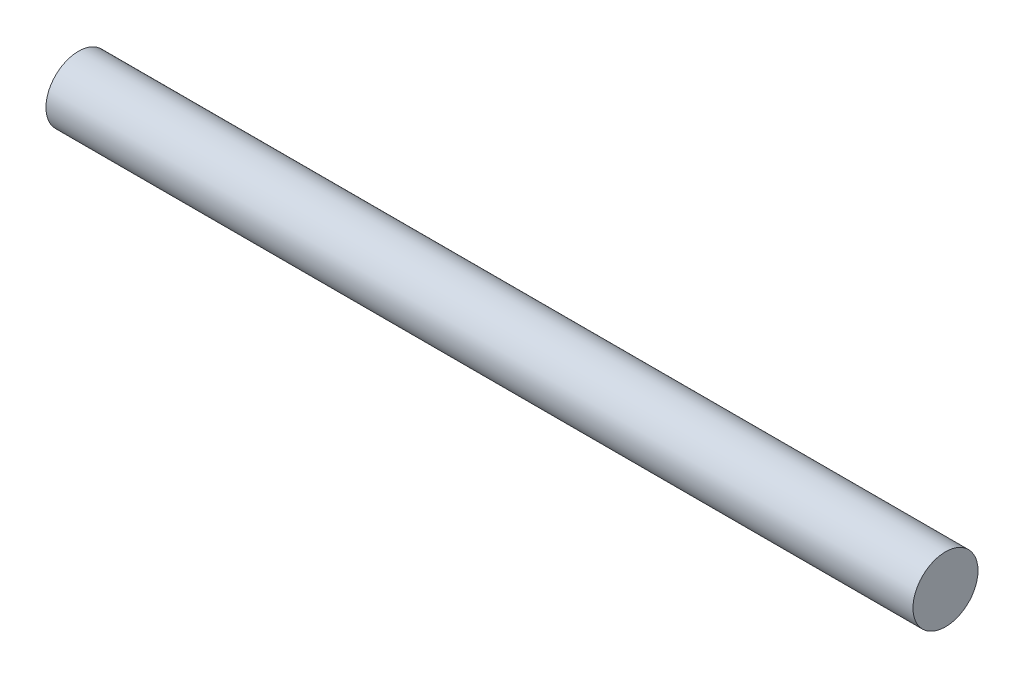
ISO-10303-21;
HEADER;
FILE_DESCRIPTION(('STEP AP214'),'2;1');
FILE_NAME('part.step','',(''),(''),'','','');
FILE_SCHEMA(('AUTOMOTIVE_DESIGN { 1 0 10303 214 1 1 1 1 }'));
ENDSEC;
DATA;
#1=APPLICATION_CONTEXT('core data for automotive mechanical design processes');
#2=APPLICATION_PROTOCOL_DEFINITION('international standard','automotive_design',2000,#1);
#3=PRODUCT_CONTEXT('',#1,'mechanical');
#4=PRODUCT('Part','Part','',(#3));
#5=PRODUCT_RELATED_PRODUCT_CATEGORY('part','',(#4));
#6=PRODUCT_DEFINITION_FORMATION('','',#4);
#7=PRODUCT_DEFINITION_CONTEXT('part definition',#1,'design');
#8=PRODUCT_DEFINITION('design','',#6,#7);
#9=PRODUCT_DEFINITION_SHAPE('','',#8);
#10=(LENGTH_UNIT() NAMED_UNIT(*) SI_UNIT(.MILLI.,.METRE.));
#11=(NAMED_UNIT(*) PLANE_ANGLE_UNIT() SI_UNIT($,.RADIAN.));
#12=(NAMED_UNIT(*) SI_UNIT($,.STERADIAN.) SOLID_ANGLE_UNIT());
#13=UNCERTAINTY_MEASURE_WITH_UNIT(LENGTH_MEASURE(1.E-05),#10,'distance_accuracy_value','');
#14=(GEOMETRIC_REPRESENTATION_CONTEXT(3) GLOBAL_UNCERTAINTY_ASSIGNED_CONTEXT((#13)) GLOBAL_UNIT_ASSIGNED_CONTEXT((#10,
#11,#12)) REPRESENTATION_CONTEXT('',''));
#15=CARTESIAN_POINT('',(0.,0.,0.));
#16=DIRECTION('',(0.,0.,1.));
#17=DIRECTION('',(1.,0.,0.));
#18=AXIS2_PLACEMENT_3D('',#15,#16,#17);
#19=CARTESIAN_POINT('',(20.,11.0629921714462,22.6945002168009));
#20=DIRECTION('',(-1.,0.,0.));
#21=DIRECTION('',(0.,0.,1.));
#22=AXIS2_PLACEMENT_3D('',#19,#20,#21);
#23=CYLINDRICAL_SURFACE('',#22,0.750000000000002);
#24=CARTESIAN_POINT('',(20.,11.0629921714462,22.6945002168009));
#25=DIRECTION('',(1.,0.,0.));
#26=DIRECTION('',(0.,0.,-1.));
#27=AXIS2_PLACEMENT_3D('',#24,#25,#26);
#28=CIRCLE('',#27,0.750000000000002);
#29=CARTESIAN_POINT('',(20.,11.0629921714462,21.9445002168009));
#30=VERTEX_POINT('',#29);
#31=EDGE_CURVE('E10',#30,#30,#28,.T.);
#32=ORIENTED_EDGE('',*,*,#31,.F.);
#33=EDGE_LOOP('',(#32));
#34=FACE_BOUND('',#33,.T.);
#35=CARTESIAN_POINT('',(0.,11.0629921714462,22.6945002168009));
#36=DIRECTION('',(1.,0.,0.));
#37=DIRECTION('',(0.,0.,-1.));
#38=AXIS2_PLACEMENT_3D('',#35,#36,#37);
#39=CIRCLE('',#38,0.750000000000002);
#40=CARTESIAN_POINT('',(0.,11.0629921714462,21.9445002168009));
#41=VERTEX_POINT('',#40);
#42=EDGE_CURVE('E36',#41,#41,#39,.T.);
#43=ORIENTED_EDGE('',*,*,#42,.T.);
#44=EDGE_LOOP('',(#43));
#45=FACE_BOUND('',#44,.T.);
#46=ADVANCED_FACE('F33',(#34,#45),#23,.T.);
#47=CARTESIAN_POINT('',(20.,11.0629921714462,22.6945002168009));
#48=DIRECTION('',(1.,0.,0.));
#49=DIRECTION('',(0.,0.,-1.));
#50=AXIS2_PLACEMENT_3D('',#47,#48,#49);
#51=PLANE('',#50);
#52=ORIENTED_EDGE('',*,*,#31,.T.);
#53=EDGE_LOOP('',(#52));
#54=FACE_BOUND('',#53,.T.);
#55=ADVANCED_FACE('F48',(#54),#51,.T.);
#56=CARTESIAN_POINT('',(0.,11.0629921714462,22.6945002168009));
#57=DIRECTION('',(1.,0.,0.));
#58=DIRECTION('',(0.,0.,-1.));
#59=AXIS2_PLACEMENT_3D('',#56,#57,#58);
#60=PLANE('',#59);
#61=ORIENTED_EDGE('',*,*,#42,.F.);
#62=EDGE_LOOP('',(#61));
#63=FACE_BOUND('',#62,.T.);
#64=ADVANCED_FACE('F46',(#63),#60,.F.);
#65=CLOSED_SHELL('',(#46,#55,#64));
#66=MANIFOLD_SOLID_BREP('B2',#65);
#67=ADVANCED_BREP_SHAPE_REPRESENTATION('',(#18,#66),#14);
#68=SHAPE_DEFINITION_REPRESENTATION(#9,#67);
ENDSEC;
END-ISO-10303-21;
